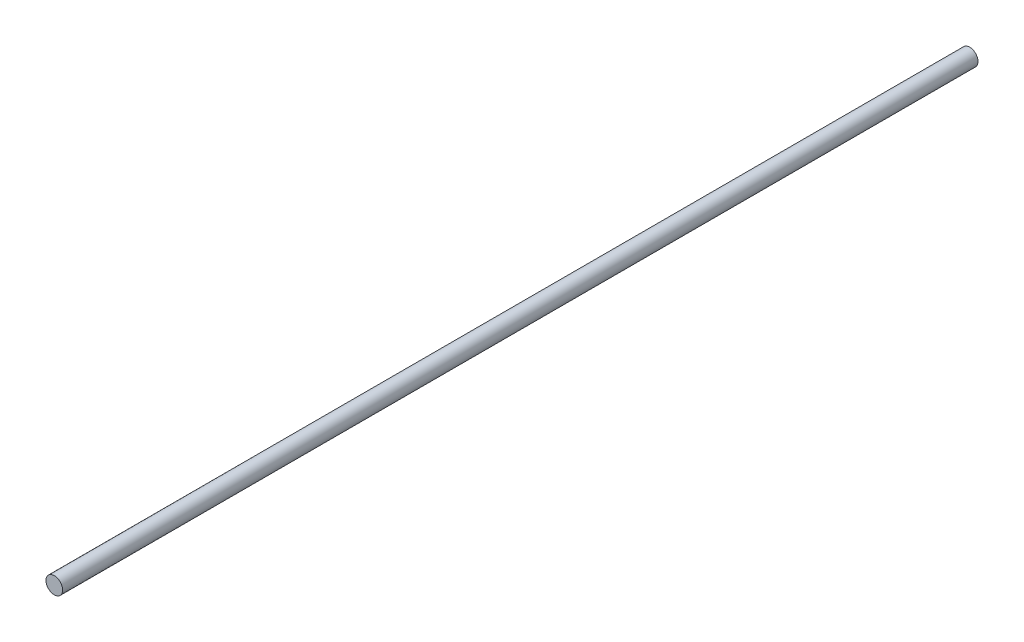
ISO-10303-21;
HEADER;
FILE_DESCRIPTION(('STEP AP214'),'2;1');
FILE_NAME('part.step','',(''),(''),'','','');
FILE_SCHEMA(('AUTOMOTIVE_DESIGN { 1 0 10303 214 1 1 1 1 }'));
ENDSEC;
DATA;
#1=APPLICATION_CONTEXT('core data for automotive mechanical design processes');
#2=APPLICATION_PROTOCOL_DEFINITION('international standard','automotive_design',2000,#1);
#3=PRODUCT_CONTEXT('',#1,'mechanical');
#4=PRODUCT('Part','Part','',(#3));
#5=PRODUCT_RELATED_PRODUCT_CATEGORY('part','',(#4));
#6=PRODUCT_DEFINITION_FORMATION('','',#4);
#7=PRODUCT_DEFINITION_CONTEXT('part definition',#1,'design');
#8=PRODUCT_DEFINITION('design','',#6,#7);
#9=PRODUCT_DEFINITION_SHAPE('','',#8);
#10=(LENGTH_UNIT() NAMED_UNIT(*) SI_UNIT(.MILLI.,.METRE.));
#11=(NAMED_UNIT(*) PLANE_ANGLE_UNIT() SI_UNIT($,.RADIAN.));
#12=(NAMED_UNIT(*) SI_UNIT($,.STERADIAN.) SOLID_ANGLE_UNIT());
#13=UNCERTAINTY_MEASURE_WITH_UNIT(LENGTH_MEASURE(1.E-05),#10,'distance_accuracy_value','');
#14=(GEOMETRIC_REPRESENTATION_CONTEXT(3) GLOBAL_UNCERTAINTY_ASSIGNED_CONTEXT((#13)) GLOBAL_UNIT_ASSIGNED_CONTEXT((#10,
#11,#12)) REPRESENTATION_CONTEXT('',''));
#15=CARTESIAN_POINT('',(0.,0.,0.));
#16=DIRECTION('',(0.,0.,1.));
#17=DIRECTION('',(1.,0.,0.));
#18=AXIS2_PLACEMENT_3D('',#15,#16,#17);
#19=CARTESIAN_POINT('',(0.,0.,440.));
#20=DIRECTION('',(0.,0.,-1.));
#21=DIRECTION('',(-1.,0.,0.));
#22=AXIS2_PLACEMENT_3D('',#19,#20,#21);
#23=CYLINDRICAL_SURFACE('',#22,4.);
#24=CARTESIAN_POINT('',(0.,0.,440.));
#25=DIRECTION('',(0.,0.,1.));
#26=DIRECTION('',(1.,0.,0.));
#27=AXIS2_PLACEMENT_3D('',#24,#25,#26);
#28=CIRCLE('',#27,4.);
#29=CARTESIAN_POINT('',(4.,0.,440.));
#30=VERTEX_POINT('',#29);
#31=EDGE_CURVE('E10',#30,#30,#28,.T.);
#32=ORIENTED_EDGE('',*,*,#31,.F.);
#33=EDGE_LOOP('',(#32));
#34=FACE_BOUND('',#33,.T.);
#35=CARTESIAN_POINT('',(0.,0.,0.));
#36=DIRECTION('',(0.,0.,1.));
#37=DIRECTION('',(1.,0.,0.));
#38=AXIS2_PLACEMENT_3D('',#35,#36,#37);
#39=CIRCLE('',#38,4.);
#40=CARTESIAN_POINT('',(4.,0.,0.));
#41=VERTEX_POINT('',#40);
#42=EDGE_CURVE('E34',#41,#41,#39,.T.);
#43=ORIENTED_EDGE('',*,*,#42,.T.);
#44=EDGE_LOOP('',(#43));
#45=FACE_BOUND('',#44,.T.);
#46=ADVANCED_FACE('F31',(#34,#45),#23,.T.);
#47=CARTESIAN_POINT('',(0.,0.,440.));
#48=DIRECTION('',(0.,0.,1.));
#49=DIRECTION('',(1.,0.,0.));
#50=AXIS2_PLACEMENT_3D('',#47,#48,#49);
#51=PLANE('',#50);
#52=ORIENTED_EDGE('',*,*,#31,.T.);
#53=EDGE_LOOP('',(#52));
#54=FACE_BOUND('',#53,.T.);
#55=ADVANCED_FACE('F46',(#54),#51,.T.);
#56=CARTESIAN_POINT('',(0.,0.,0.));
#57=DIRECTION('',(0.,0.,1.));
#58=DIRECTION('',(1.,0.,0.));
#59=AXIS2_PLACEMENT_3D('',#56,#57,#58);
#60=PLANE('',#59);
#61=ORIENTED_EDGE('',*,*,#42,.F.);
#62=EDGE_LOOP('',(#61));
#63=FACE_BOUND('',#62,.T.);
#64=ADVANCED_FACE('F44',(#63),#60,.F.);
#65=CLOSED_SHELL('',(#46,#55,#64));
#66=MANIFOLD_SOLID_BREP('B2',#65);
#67=ADVANCED_BREP_SHAPE_REPRESENTATION('',(#18,#66),#14);
#68=SHAPE_DEFINITION_REPRESENTATION(#9,#67);
ENDSEC;
END-ISO-10303-21;
